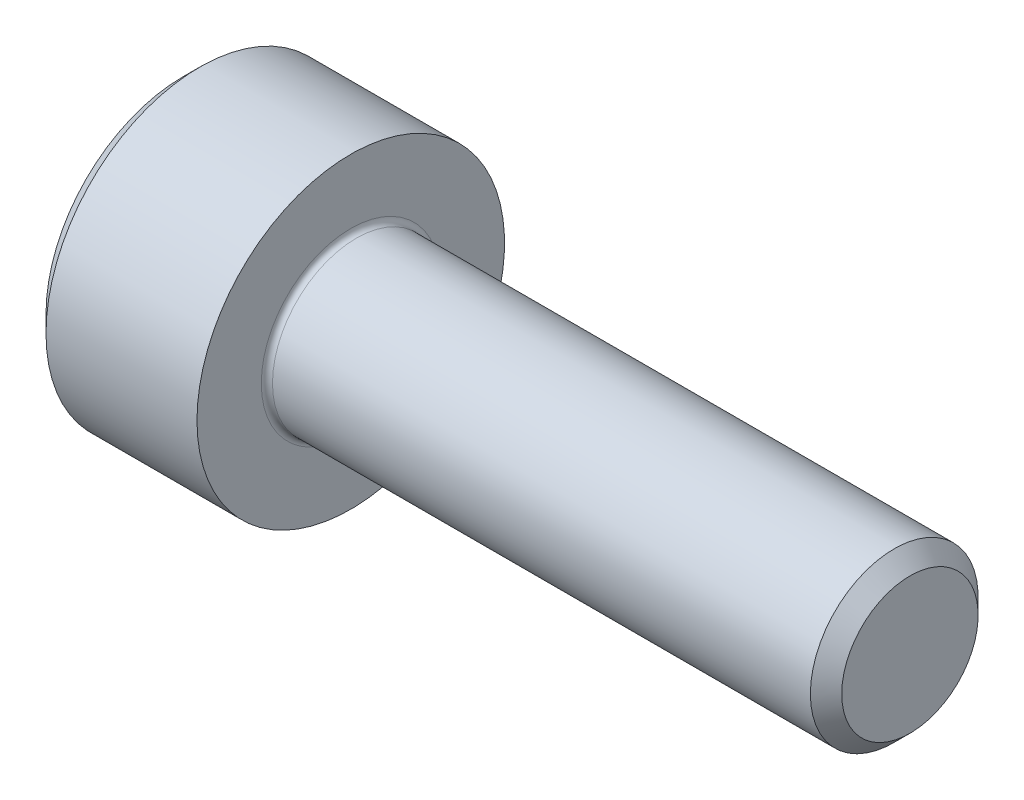
ISO-10303-21;
HEADER;
FILE_DESCRIPTION(('STEP AP214'),'2;1');
FILE_NAME('part.step','',(''),(''),'','','');
FILE_SCHEMA(('AUTOMOTIVE_DESIGN { 1 0 10303 214 1 1 1 1 }'));
ENDSEC;
DATA;
#1=APPLICATION_CONTEXT('core data for automotive mechanical design processes');
#2=APPLICATION_PROTOCOL_DEFINITION('international standard','automotive_design',2000,#1);
#3=PRODUCT_CONTEXT('',#1,'mechanical');
#4=PRODUCT('Part','Part','',(#3));
#5=PRODUCT_RELATED_PRODUCT_CATEGORY('part','',(#4));
#6=PRODUCT_DEFINITION_FORMATION('','',#4);
#7=PRODUCT_DEFINITION_CONTEXT('part definition',#1,'design');
#8=PRODUCT_DEFINITION('design','',#6,#7);
#9=PRODUCT_DEFINITION_SHAPE('','',#8);
#10=(LENGTH_UNIT() NAMED_UNIT(*) SI_UNIT(.MILLI.,.METRE.));
#11=(NAMED_UNIT(*) PLANE_ANGLE_UNIT() SI_UNIT($,.RADIAN.));
#12=(NAMED_UNIT(*) SI_UNIT($,.STERADIAN.) SOLID_ANGLE_UNIT());
#13=UNCERTAINTY_MEASURE_WITH_UNIT(LENGTH_MEASURE(1.E-05),#10,'distance_accuracy_value','');
#14=(GEOMETRIC_REPRESENTATION_CONTEXT(3) GLOBAL_UNCERTAINTY_ASSIGNED_CONTEXT((#13)) GLOBAL_UNIT_ASSIGNED_CONTEXT((#10,
#11,#12)) REPRESENTATION_CONTEXT('',''));
#15=CARTESIAN_POINT('',(0.,0.,0.));
#16=DIRECTION('',(0.,0.,1.));
#17=DIRECTION('',(1.,0.,0.));
#18=AXIS2_PLACEMENT_3D('',#15,#16,#17);
#19=CARTESIAN_POINT('',(0.,0.,0.));
#20=DIRECTION('',(-1.,0.,0.));
#21=DIRECTION('',(0.,0.,1.));
#22=AXIS2_PLACEMENT_3D('',#19,#20,#21);
#23=PLANE('',#22);
#24=DIRECTION('',(0.,-0.499999999999999,0.866025403784439));
#25=VECTOR('',#24,1.);
#26=CARTESIAN_POINT('',(0.,1.47801668912544,0.));
#27=LINE('',#26,#25);
#28=CARTESIAN_POINT('',(0.,1.47801668912544,0.));
#29=VERTEX_POINT('',#28);
#30=CARTESIAN_POINT('',(0.,0.739008344562719,1.28));
#31=VERTEX_POINT('',#30);
#32=EDGE_CURVE('E376',#29,#31,#27,.T.);
#33=ORIENTED_EDGE('',*,*,#32,.T.);
#34=DIRECTION('',(0.,1.,0.));
#35=VECTOR('',#34,1.);
#36=CARTESIAN_POINT('',(0.,-0.739008344562723,1.28));
#37=LINE('',#36,#35);
#38=CARTESIAN_POINT('',(0.,-0.739008344562723,1.28));
#39=VERTEX_POINT('',#38);
#40=EDGE_CURVE('E124',#39,#31,#37,.T.);
#41=ORIENTED_EDGE('',*,*,#40,.F.);
#42=DIRECTION('',(0.,-0.500000000000001,-0.866025403784438));
#43=VECTOR('',#42,1.);
#44=CARTESIAN_POINT('',(0.,-0.739008344562723,1.28));
#45=LINE('',#44,#43);
#46=CARTESIAN_POINT('',(0.,-1.47801668912545,0.));
#47=VERTEX_POINT('',#46);
#48=EDGE_CURVE('E379',#39,#47,#45,.T.);
#49=ORIENTED_EDGE('',*,*,#48,.T.);
#50=DIRECTION('',(0.,0.499999999999999,-0.866025403784439));
#51=VECTOR('',#50,1.);
#52=CARTESIAN_POINT('',(0.,-1.47801668912545,0.));
#53=LINE('',#52,#51);
#54=CARTESIAN_POINT('',(0.,-0.739008344562727,-1.28));
#55=VERTEX_POINT('',#54);
#56=EDGE_CURVE('E382',#47,#55,#53,.T.);
#57=ORIENTED_EDGE('',*,*,#56,.T.);
#58=DIRECTION('',(0.,-1.,0.));
#59=VECTOR('',#58,1.);
#60=CARTESIAN_POINT('',(0.,0.739008344562716,-1.28));
#61=LINE('',#60,#59);
#62=CARTESIAN_POINT('',(0.,0.739008344562716,-1.28));
#63=VERTEX_POINT('',#62);
#64=EDGE_CURVE('E385',#63,#55,#61,.T.);
#65=ORIENTED_EDGE('',*,*,#64,.F.);
#66=DIRECTION('',(0.,-0.500000000000001,-0.866025403784438));
#67=VECTOR('',#66,1.);
#68=CARTESIAN_POINT('',(0.,1.47801668912544,0.));
#69=LINE('',#68,#67);
#70=EDGE_CURVE('E119',#29,#63,#69,.T.);
#71=ORIENTED_EDGE('',*,*,#70,.F.);
#72=EDGE_LOOP('',(#33,#41,#49,#57,#65,#71));
#73=FACE_BOUND('',#72,.T.);
#74=CARTESIAN_POINT('',(0.,0.,0.));
#75=DIRECTION('',(-1.,0.,0.));
#76=DIRECTION('',(0.,0.,1.));
#77=AXIS2_PLACEMENT_3D('',#74,#75,#76);
#78=CIRCLE('',#77,2.45);
#79=CARTESIAN_POINT('',(0.,0.,2.45));
#80=VERTEX_POINT('',#79);
#81=EDGE_CURVE('E135',#80,#80,#78,.T.);
#82=ORIENTED_EDGE('',*,*,#81,.T.);
#83=EDGE_LOOP('',(#82));
#84=FACE_BOUND('',#83,.T.);
#85=ADVANCED_FACE('F32',(#73,#84),#23,.T.);
#86=CARTESIAN_POINT('',(13.,1.2195,0.));
#87=DIRECTION('',(1.,0.,0.));
#88=DIRECTION('',(0.,0.,-1.));
#89=AXIS2_PLACEMENT_3D('',#86,#87,#88);
#90=PLANE('',#89);
#91=CARTESIAN_POINT('',(13.,0.,0.));
#92=DIRECTION('',(-1.,0.,0.));
#93=DIRECTION('',(0.,0.,1.));
#94=AXIS2_PLACEMENT_3D('',#91,#92,#93);
#95=CIRCLE('',#94,1.2195);
#96=CARTESIAN_POINT('',(13.,0.,1.2195));
#97=VERTEX_POINT('',#96);
#98=EDGE_CURVE('E148',#97,#97,#95,.T.);
#99=ORIENTED_EDGE('',*,*,#98,.F.);
#100=EDGE_LOOP('',(#99));
#101=FACE_BOUND('',#100,.T.);
#102=ADVANCED_FACE('F169',(#101),#90,.T.);
#103=CARTESIAN_POINT('',(13.,0.,0.));
#104=DIRECTION('',(-1.,0.,0.));
#105=DIRECTION('',(0.,0.,1.));
#106=AXIS2_PLACEMENT_3D('',#103,#104,#105);
#107=CONICAL_SURFACE('',#106,1.2195,0.785398163397467);
#108=CARTESIAN_POINT('',(12.7195,0.,0.));
#109=DIRECTION('',(-1.,0.,0.));
#110=DIRECTION('',(0.,0.,1.));
#111=AXIS2_PLACEMENT_3D('',#108,#109,#110);
#112=CIRCLE('',#111,1.5);
#113=CARTESIAN_POINT('',(12.7195,0.,1.5));
#114=VERTEX_POINT('',#113);
#115=EDGE_CURVE('E145',#114,#114,#112,.T.);
#116=ORIENTED_EDGE('',*,*,#115,.F.);
#117=EDGE_LOOP('',(#116));
#118=FACE_BOUND('',#117,.T.);
#119=ORIENTED_EDGE('',*,*,#98,.T.);
#120=EDGE_LOOP('',(#119));
#121=FACE_BOUND('',#120,.T.);
#122=ADVANCED_FACE('F175',(#118,#121),#107,.T.);
#123=CARTESIAN_POINT('',(-31.75,0.,0.));
#124=DIRECTION('',(-1.,0.,0.));
#125=DIRECTION('',(0.,0.,1.));
#126=AXIS2_PLACEMENT_3D('',#123,#124,#125);
#127=CYLINDRICAL_SURFACE('',#126,1.5);
#128=CARTESIAN_POINT('',(3.1,0.,0.));
#129=DIRECTION('',(1.,0.,0.));
#130=DIRECTION('',(0.,0.,-1.));
#131=AXIS2_PLACEMENT_3D('',#128,#129,#130);
#132=CIRCLE('',#131,1.5);
#133=CARTESIAN_POINT('',(3.1,0.,-1.5));
#134=VERTEX_POINT('',#133);
#135=EDGE_CURVE('E11',#134,#134,#132,.T.);
#136=ORIENTED_EDGE('',*,*,#135,.T.);
#137=EDGE_LOOP('',(#136));
#138=FACE_BOUND('',#137,.T.);
#139=ORIENTED_EDGE('',*,*,#115,.T.);
#140=EDGE_LOOP('',(#139));
#141=FACE_BOUND('',#140,.T.);
#142=ADVANCED_FACE('F186',(#138,#141),#127,.T.);
#143=CARTESIAN_POINT('',(3.,2.75,0.));
#144=DIRECTION('',(1.,0.,0.));
#145=DIRECTION('',(0.,0.,-1.));
#146=AXIS2_PLACEMENT_3D('',#143,#144,#145);
#147=PLANE('',#146);
#148=CARTESIAN_POINT('',(3.,0.,0.));
#149=DIRECTION('',(1.,0.,0.));
#150=DIRECTION('',(0.,0.,-1.));
#151=AXIS2_PLACEMENT_3D('',#148,#149,#150);
#152=CIRCLE('',#151,1.6);
#153=CARTESIAN_POINT('',(3.,0.,-1.6));
#154=VERTEX_POINT('',#153);
#155=EDGE_CURVE('E40',#154,#154,#152,.F.);
#156=ORIENTED_EDGE('',*,*,#155,.T.);
#157=EDGE_LOOP('',(#156));
#158=FACE_BOUND('',#157,.T.);
#159=CARTESIAN_POINT('',(3.,0.,0.));
#160=DIRECTION('',(-1.,0.,0.));
#161=DIRECTION('',(0.,0.,1.));
#162=AXIS2_PLACEMENT_3D('',#159,#160,#161);
#163=CIRCLE('',#162,2.75);
#164=CARTESIAN_POINT('',(3.,0.,2.75));
#165=VERTEX_POINT('',#164);
#166=EDGE_CURVE('E142',#165,#165,#163,.T.);
#167=ORIENTED_EDGE('',*,*,#166,.F.);
#168=EDGE_LOOP('',(#167));
#169=FACE_BOUND('',#168,.T.);
#170=ADVANCED_FACE('F153',(#158,#169),#147,.T.);
#171=CARTESIAN_POINT('',(-31.75,0.,0.));
#172=DIRECTION('',(-1.,0.,0.));
#173=DIRECTION('',(0.,0.,1.));
#174=AXIS2_PLACEMENT_3D('',#171,#172,#173);
#175=CYLINDRICAL_SURFACE('',#174,2.75);
#176=ORIENTED_EDGE('',*,*,#166,.T.);
#177=EDGE_LOOP('',(#176));
#178=FACE_BOUND('',#177,.T.);
#179=CARTESIAN_POINT('',(0.300000000000002,0.,0.));
#180=DIRECTION('',(-1.,0.,0.));
#181=DIRECTION('',(0.,0.,1.));
#182=AXIS2_PLACEMENT_3D('',#179,#180,#181);
#183=CIRCLE('',#182,2.75);
#184=CARTESIAN_POINT('',(0.300000000000002,0.,2.75));
#185=VERTEX_POINT('',#184);
#186=EDGE_CURVE('E139',#185,#185,#183,.T.);
#187=ORIENTED_EDGE('',*,*,#186,.F.);
#188=EDGE_LOOP('',(#187));
#189=FACE_BOUND('',#188,.T.);
#190=ADVANCED_FACE('F164',(#178,#189),#175,.T.);
#191=CARTESIAN_POINT('',(0.,0.,0.));
#192=DIRECTION('',(1.,0.,0.));
#193=DIRECTION('',(0.,0.,-1.));
#194=AXIS2_PLACEMENT_3D('',#191,#192,#193);
#195=CONICAL_SURFACE('',#194,2.45,0.785398163397447);
#196=ORIENTED_EDGE('',*,*,#186,.T.);
#197=EDGE_LOOP('',(#196));
#198=FACE_BOUND('',#197,.T.);
#199=ORIENTED_EDGE('',*,*,#81,.F.);
#200=EDGE_LOOP('',(#199));
#201=FACE_BOUND('',#200,.T.);
#202=ADVANCED_FACE('F157',(#198,#201),#195,.T.);
#203=CARTESIAN_POINT('',(3.1,0.,0.));
#204=DIRECTION('',(1.,0.,0.));
#205=DIRECTION('',(0.,0.,-1.));
#206=AXIS2_PLACEMENT_3D('',#203,#204,#205);
#207=TOROIDAL_SURFACE('',#206,1.6,0.1);
#208=ORIENTED_EDGE('',*,*,#135,.F.);
#209=EDGE_LOOP('',(#208));
#210=FACE_BOUND('',#209,.T.);
#211=ORIENTED_EDGE('',*,*,#155,.F.);
#212=EDGE_LOOP('',(#211));
#213=FACE_BOUND('',#212,.T.);
#214=ADVANCED_FACE('F34',(#210,#213),#207,.F.);
#215=CARTESIAN_POINT('',(1.3,1.47801668912544,0.));
#216=DIRECTION('',(0.,-0.866025403784439,-0.499999999999999));
#217=DIRECTION('',(0.,0.499999999999999,-0.866025403784439));
#218=AXIS2_PLACEMENT_3D('',#215,#216,#217);
#219=PLANE('',#218);
#220=ORIENTED_EDGE('',*,*,#32,.F.);
#221=DIRECTION('',(-1.,0.,0.));
#222=VECTOR('',#221,1.);
#223=CARTESIAN_POINT('',(1.3,1.47801668912544,0.));
#224=LINE('',#223,#222);
#225=CARTESIAN_POINT('',(1.3,1.47801668912544,0.));
#226=VERTEX_POINT('',#225);
#227=EDGE_CURVE('E375',#226,#29,#224,.T.);
#228=ORIENTED_EDGE('',*,*,#227,.F.);
#229=DIRECTION('',(0.,-0.499999999999999,0.866025403784439));
#230=VECTOR('',#229,1.);
#231=CARTESIAN_POINT('',(1.3,1.47801668912544,0.));
#232=LINE('',#231,#230);
#233=CARTESIAN_POINT('',(1.3,1.10851251684408,0.639999999999998));
#234=VERTEX_POINT('',#233);
#235=EDGE_CURVE('E47',#226,#234,#232,.T.);
#236=ORIENTED_EDGE('',*,*,#235,.T.);
#237=CARTESIAN_POINT('',(1.3,0.739008344562719,1.28));
#238=VERTEX_POINT('',#237);
#239=EDGE_CURVE('E105',#234,#238,#232,.T.);
#240=ORIENTED_EDGE('',*,*,#239,.T.);
#241=DIRECTION('',(-1.,0.,0.));
#242=VECTOR('',#241,1.);
#243=CARTESIAN_POINT('',(1.3,0.739008344562719,1.28));
#244=LINE('',#243,#242);
#245=EDGE_CURVE('E117',#238,#31,#244,.T.);
#246=ORIENTED_EDGE('',*,*,#245,.T.);
#247=EDGE_LOOP('',(#220,#228,#236,#240,#246));
#248=FACE_BOUND('',#247,.T.);
#249=ADVANCED_FACE('F116',(#248),#219,.T.);
#250=CARTESIAN_POINT('',(1.3,-0.739008344562723,1.28));
#251=DIRECTION('',(0.,0.,1.));
#252=DIRECTION('',(0.,-1.,0.));
#253=AXIS2_PLACEMENT_3D('',#250,#251,#252);
#254=PLANE('',#253);
#255=ORIENTED_EDGE('',*,*,#40,.T.);
#256=ORIENTED_EDGE('',*,*,#245,.F.);
#257=DIRECTION('',(0.,1.,0.));
#258=VECTOR('',#257,1.);
#259=CARTESIAN_POINT('',(1.3,-0.739008344562723,1.28));
#260=LINE('',#259,#258);
#261=CARTESIAN_POINT('',(1.3,0.,1.28));
#262=VERTEX_POINT('',#261);
#263=EDGE_CURVE('E103',#262,#238,#260,.T.);
#264=ORIENTED_EDGE('',*,*,#263,.F.);
#265=CARTESIAN_POINT('',(1.3,-0.739008344562723,1.28));
#266=VERTEX_POINT('',#265);
#267=EDGE_CURVE('E113',#266,#262,#260,.T.);
#268=ORIENTED_EDGE('',*,*,#267,.F.);
#269=DIRECTION('',(-1.,0.,0.));
#270=VECTOR('',#269,1.);
#271=CARTESIAN_POINT('',(1.3,-0.739008344562723,1.28));
#272=LINE('',#271,#270);
#273=EDGE_CURVE('E126',#266,#39,#272,.T.);
#274=ORIENTED_EDGE('',*,*,#273,.T.);
#275=EDGE_LOOP('',(#255,#256,#264,#268,#274));
#276=FACE_BOUND('',#275,.T.);
#277=ADVANCED_FACE('F121',(#276),#254,.F.);
#278=CARTESIAN_POINT('',(1.3,-0.739008344562723,1.28));
#279=DIRECTION('',(0.,0.866025403784438,-0.500000000000001));
#280=DIRECTION('',(0.,0.500000000000001,0.866025403784438));
#281=AXIS2_PLACEMENT_3D('',#278,#279,#280);
#282=PLANE('',#281);
#283=ORIENTED_EDGE('',*,*,#48,.F.);
#284=ORIENTED_EDGE('',*,*,#273,.F.);
#285=DIRECTION('',(0.,-0.500000000000001,-0.866025403784438));
#286=VECTOR('',#285,1.);
#287=CARTESIAN_POINT('',(1.3,-0.739008344562723,1.28));
#288=LINE('',#287,#286);
#289=CARTESIAN_POINT('',(1.3,-1.10851251684408,0.640000000000003));
#290=VERTEX_POINT('',#289);
#291=EDGE_CURVE('E356',#266,#290,#288,.T.);
#292=ORIENTED_EDGE('',*,*,#291,.T.);
#293=CARTESIAN_POINT('',(1.3,-1.47801668912545,0.));
#294=VERTEX_POINT('',#293);
#295=EDGE_CURVE('E358',#290,#294,#288,.T.);
#296=ORIENTED_EDGE('',*,*,#295,.T.);
#297=DIRECTION('',(-1.,0.,0.));
#298=VECTOR('',#297,1.);
#299=CARTESIAN_POINT('',(1.3,-1.47801668912545,0.));
#300=LINE('',#299,#298);
#301=EDGE_CURVE('E131',#294,#47,#300,.T.);
#302=ORIENTED_EDGE('',*,*,#301,.T.);
#303=EDGE_LOOP('',(#283,#284,#292,#296,#302));
#304=FACE_BOUND('',#303,.T.);
#305=ADVANCED_FACE('F248',(#304),#282,.T.);
#306=CARTESIAN_POINT('',(1.3,-1.47801668912545,0.));
#307=DIRECTION('',(0.,0.866025403784439,0.499999999999999));
#308=DIRECTION('',(0.,-0.499999999999999,0.866025403784439));
#309=AXIS2_PLACEMENT_3D('',#306,#307,#308);
#310=PLANE('',#309);
#311=ORIENTED_EDGE('',*,*,#56,.F.);
#312=ORIENTED_EDGE('',*,*,#301,.F.);
#313=DIRECTION('',(0.,0.499999999999999,-0.866025403784439));
#314=VECTOR('',#313,1.);
#315=CARTESIAN_POINT('',(1.3,-1.47801668912545,0.));
#316=LINE('',#315,#314);
#317=CARTESIAN_POINT('',(1.3,-1.10851251684409,-0.64));
#318=VERTEX_POINT('',#317);
#319=EDGE_CURVE('E361',#294,#318,#316,.T.);
#320=ORIENTED_EDGE('',*,*,#319,.T.);
#321=CARTESIAN_POINT('',(1.3,-0.739008344562727,-1.28));
#322=VERTEX_POINT('',#321);
#323=EDGE_CURVE('E365',#318,#322,#316,.T.);
#324=ORIENTED_EDGE('',*,*,#323,.T.);
#325=DIRECTION('',(-1.,0.,0.));
#326=VECTOR('',#325,1.);
#327=CARTESIAN_POINT('',(1.3,-0.739008344562727,-1.28));
#328=LINE('',#327,#326);
#329=EDGE_CURVE('E394',#322,#55,#328,.T.);
#330=ORIENTED_EDGE('',*,*,#329,.T.);
#331=EDGE_LOOP('',(#311,#312,#320,#324,#330));
#332=FACE_BOUND('',#331,.T.);
#333=ADVANCED_FACE('F256',(#332),#310,.T.);
#334=CARTESIAN_POINT('',(1.3,0.739008344562716,-1.28));
#335=DIRECTION('',(0.,0.,-1.));
#336=DIRECTION('',(0.,1.,0.));
#337=AXIS2_PLACEMENT_3D('',#334,#335,#336);
#338=PLANE('',#337);
#339=ORIENTED_EDGE('',*,*,#64,.T.);
#340=ORIENTED_EDGE('',*,*,#329,.F.);
#341=DIRECTION('',(0.,-1.,0.));
#342=VECTOR('',#341,1.);
#343=CARTESIAN_POINT('',(1.3,0.739008344562716,-1.28));
#344=LINE('',#343,#342);
#345=CARTESIAN_POINT('',(1.3,0.,-1.28));
#346=VERTEX_POINT('',#345);
#347=EDGE_CURVE('E369',#346,#322,#344,.T.);
#348=ORIENTED_EDGE('',*,*,#347,.F.);
#349=CARTESIAN_POINT('',(1.3,0.739008344562716,-1.28));
#350=VERTEX_POINT('',#349);
#351=EDGE_CURVE('E370',#350,#346,#344,.T.);
#352=ORIENTED_EDGE('',*,*,#351,.F.);
#353=DIRECTION('',(-1.,0.,0.));
#354=VECTOR('',#353,1.);
#355=CARTESIAN_POINT('',(1.3,0.739008344562716,-1.28));
#356=LINE('',#355,#354);
#357=EDGE_CURVE('E391',#350,#63,#356,.T.);
#358=ORIENTED_EDGE('',*,*,#357,.T.);
#359=EDGE_LOOP('',(#339,#340,#348,#352,#358));
#360=FACE_BOUND('',#359,.T.);
#361=ADVANCED_FACE('F265',(#360),#338,.F.);
#362=CARTESIAN_POINT('',(1.3,1.47801668912544,0.));
#363=DIRECTION('',(0.,0.866025403784438,-0.500000000000001));
#364=DIRECTION('',(0.,0.500000000000001,0.866025403784438));
#365=AXIS2_PLACEMENT_3D('',#362,#363,#364);
#366=PLANE('',#365);
#367=ORIENTED_EDGE('',*,*,#70,.T.);
#368=ORIENTED_EDGE('',*,*,#357,.F.);
#369=DIRECTION('',(0.,-0.500000000000001,-0.866025403784438));
#370=VECTOR('',#369,1.);
#371=CARTESIAN_POINT('',(1.3,1.47801668912544,0.));
#372=LINE('',#371,#370);
#373=CARTESIAN_POINT('',(1.3,1.10851251684408,-0.64));
#374=VERTEX_POINT('',#373);
#375=EDGE_CURVE('E373',#374,#350,#372,.T.);
#376=ORIENTED_EDGE('',*,*,#375,.F.);
#377=EDGE_CURVE('E347',#226,#374,#372,.T.);
#378=ORIENTED_EDGE('',*,*,#377,.F.);
#379=ORIENTED_EDGE('',*,*,#227,.T.);
#380=EDGE_LOOP('',(#367,#368,#376,#378,#379));
#381=FACE_BOUND('',#380,.T.);
#382=ADVANCED_FACE('F274',(#381),#366,.F.);
#383=CARTESIAN_POINT('',(1.3,0.739008344562719,1.28));
#384=DIRECTION('',(-1.,0.,0.));
#385=DIRECTION('',(0.,0.,1.));
#386=AXIS2_PLACEMENT_3D('',#383,#384,#385);
#387=PLANE('',#386);
#388=CARTESIAN_POINT('',(1.3,0.,0.));
#389=DIRECTION('',(-1.,0.,0.));
#390=DIRECTION('',(0.,0.,1.));
#391=AXIS2_PLACEMENT_3D('',#388,#389,#390);
#392=CIRCLE('',#391,1.28);
#393=EDGE_CURVE('E125',#290,#262,#392,.T.);
#394=ORIENTED_EDGE('',*,*,#393,.F.);
#395=ORIENTED_EDGE('',*,*,#291,.F.);
#396=ORIENTED_EDGE('',*,*,#267,.T.);
#397=EDGE_LOOP('',(#394,#395,#396));
#398=FACE_BOUND('',#397,.T.);
#399=ADVANCED_FACE('F283',(#398),#387,.T.);
#400=EDGE_CURVE('E129',#318,#290,#392,.T.);
#401=ORIENTED_EDGE('',*,*,#400,.F.);
#402=ORIENTED_EDGE('',*,*,#319,.F.);
#403=ORIENTED_EDGE('',*,*,#295,.F.);
#404=EDGE_LOOP('',(#401,#402,#403));
#405=FACE_BOUND('',#404,.T.);
#406=ADVANCED_FACE('F292',(#405),#387,.T.);
#407=EDGE_CURVE('E400',#346,#318,#392,.T.);
#408=ORIENTED_EDGE('',*,*,#407,.F.);
#409=ORIENTED_EDGE('',*,*,#347,.T.);
#410=ORIENTED_EDGE('',*,*,#323,.F.);
#411=EDGE_LOOP('',(#408,#409,#410));
#412=FACE_BOUND('',#411,.T.);
#413=ADVANCED_FACE('F301',(#412),#387,.T.);
#414=EDGE_CURVE('E350',#374,#346,#392,.T.);
#415=ORIENTED_EDGE('',*,*,#414,.F.);
#416=ORIENTED_EDGE('',*,*,#375,.T.);
#417=ORIENTED_EDGE('',*,*,#351,.T.);
#418=EDGE_LOOP('',(#415,#416,#417));
#419=FACE_BOUND('',#418,.T.);
#420=ADVANCED_FACE('F309',(#419),#387,.T.);
#421=EDGE_CURVE('E136',#234,#374,#392,.T.);
#422=ORIENTED_EDGE('',*,*,#421,.F.);
#423=ORIENTED_EDGE('',*,*,#235,.F.);
#424=ORIENTED_EDGE('',*,*,#377,.T.);
#425=EDGE_LOOP('',(#422,#423,#424));
#426=FACE_BOUND('',#425,.T.);
#427=ADVANCED_FACE('F317',(#426),#387,.T.);
#428=EDGE_CURVE('E108',#262,#234,#392,.T.);
#429=ORIENTED_EDGE('',*,*,#428,.F.);
#430=ORIENTED_EDGE('',*,*,#263,.T.);
#431=ORIENTED_EDGE('',*,*,#239,.F.);
#432=EDGE_LOOP('',(#429,#430,#431));
#433=FACE_BOUND('',#432,.T.);
#434=ADVANCED_FACE('F104',(#433),#387,.T.);
#435=CARTESIAN_POINT('',(1.3,0.,0.));
#436=DIRECTION('',(-1.,0.,0.));
#437=DIRECTION('',(0.,0.,1.));
#438=AXIS2_PLACEMENT_3D('',#435,#436,#437);
#439=CONICAL_SURFACE('',#438,1.28,1.0471975511966);
#440=CARTESIAN_POINT('',(2.03900834456273,0.,0.));
#441=VERTEX_POINT('',#440);
#442=VERTEX_LOOP('',#441);
#443=FACE_BOUND('',#442,.T.);
#444=ORIENTED_EDGE('',*,*,#428,.T.);
#445=ORIENTED_EDGE('',*,*,#421,.T.);
#446=ORIENTED_EDGE('',*,*,#414,.T.);
#447=ORIENTED_EDGE('',*,*,#407,.T.);
#448=ORIENTED_EDGE('',*,*,#400,.T.);
#449=ORIENTED_EDGE('',*,*,#393,.T.);
#450=EDGE_LOOP('',(#444,#445,#446,#447,#448,#449));
#451=FACE_BOUND('',#450,.T.);
#452=ADVANCED_FACE('F179',(#443,#451),#439,.F.);
#453=CLOSED_SHELL('',(#85,#102,#122,#142,#170,#190,#202,#214,#249,#277,#305,#333,#361,#382,#399,
#406,#413,#420,#427,#434,#452));
#454=MANIFOLD_SOLID_BREP('B2',#453);
#455=ADVANCED_BREP_SHAPE_REPRESENTATION('',(#18,#454),#14);
#456=SHAPE_DEFINITION_REPRESENTATION(#9,#455);
ENDSEC;
END-ISO-10303-21;
